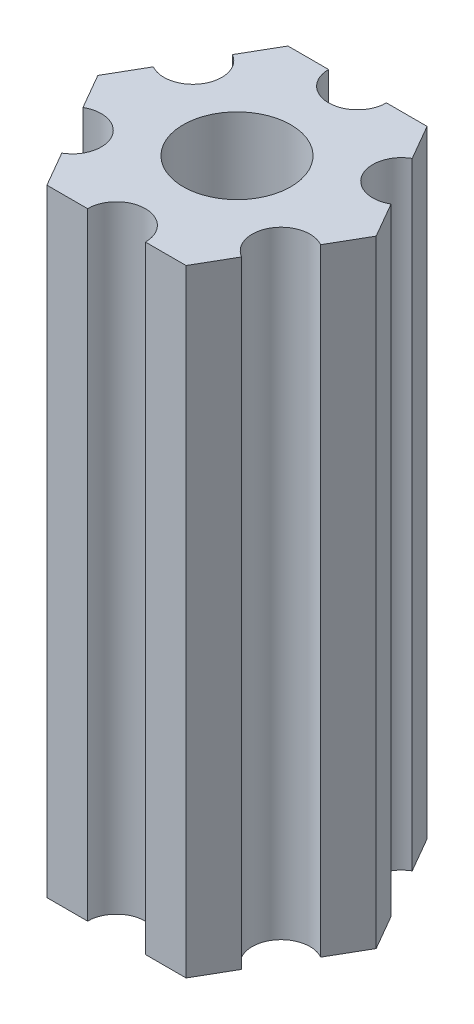
ISO-10303-21;
HEADER;
FILE_DESCRIPTION(('STEP AP214'),'2;1');
FILE_NAME('part.step','',(''),(''),'','','');
FILE_SCHEMA(('AUTOMOTIVE_DESIGN { 1 0 10303 214 1 1 1 1 }'));
ENDSEC;
DATA;
#1=APPLICATION_CONTEXT('core data for automotive mechanical design processes');
#2=APPLICATION_PROTOCOL_DEFINITION('international standard','automotive_design',2000,#1);
#3=PRODUCT_CONTEXT('',#1,'mechanical');
#4=PRODUCT('Part','Part','',(#3));
#5=PRODUCT_RELATED_PRODUCT_CATEGORY('part','',(#4));
#6=PRODUCT_DEFINITION_FORMATION('','',#4);
#7=PRODUCT_DEFINITION_CONTEXT('part definition',#1,'design');
#8=PRODUCT_DEFINITION('design','',#6,#7);
#9=PRODUCT_DEFINITION_SHAPE('','',#8);
#10=(LENGTH_UNIT() NAMED_UNIT(*) SI_UNIT(.MILLI.,.METRE.));
#11=(NAMED_UNIT(*) PLANE_ANGLE_UNIT() SI_UNIT($,.RADIAN.));
#12=(NAMED_UNIT(*) SI_UNIT($,.STERADIAN.) SOLID_ANGLE_UNIT());
#13=UNCERTAINTY_MEASURE_WITH_UNIT(LENGTH_MEASURE(1.E-05),#10,'distance_accuracy_value','');
#14=(GEOMETRIC_REPRESENTATION_CONTEXT(3) GLOBAL_UNCERTAINTY_ASSIGNED_CONTEXT((#13)) GLOBAL_UNIT_ASSIGNED_CONTEXT((#10,
#11,#12)) REPRESENTATION_CONTEXT('',''));
#15=CARTESIAN_POINT('',(0.,0.,0.));
#16=DIRECTION('',(0.,0.,1.));
#17=DIRECTION('',(1.,0.,0.));
#18=AXIS2_PLACEMENT_3D('',#15,#16,#17);
#19=CARTESIAN_POINT('',(5.41265877365274,53.,3.125));
#20=DIRECTION('',(0.,1.,0.));
#21=DIRECTION('',(0.,0.,1.));
#22=AXIS2_PLACEMENT_3D('',#19,#20,#21);
#23=CYLINDRICAL_SURFACE('',#22,1.5);
#24=CARTESIAN_POINT('',(5.41265877365274,85.,3.125));
#25=DIRECTION('',(0.,-1.,0.));
#26=DIRECTION('',(0.,0.,-1.));
#27=AXIS2_PLACEMENT_3D('',#24,#25,#26);
#28=CIRCLE('',#27,1.5);
#29=CARTESIAN_POINT('',(4.66265877365274,85.,4.42403810567666));
#30=VERTEX_POINT('',#29);
#31=CARTESIAN_POINT('',(6.16265877365274,85.,1.82596189432335));
#32=VERTEX_POINT('',#31);
#33=EDGE_CURVE('E196',#30,#32,#28,.T.);
#34=ORIENTED_EDGE('',*,*,#33,.F.);
#35=DIRECTION('',(0.,1.,0.));
#36=VECTOR('',#35,1.);
#37=CARTESIAN_POINT('',(4.66265877365274,53.,4.42403810567666));
#38=LINE('',#37,#36);
#39=CARTESIAN_POINT('',(4.66265877365274,53.,4.42403810567666));
#40=VERTEX_POINT('',#39);
#41=EDGE_CURVE('E11',#40,#30,#38,.T.);
#42=ORIENTED_EDGE('',*,*,#41,.F.);
#43=CARTESIAN_POINT('',(5.41265877365274,53.,3.125));
#44=DIRECTION('',(0.,-1.,0.));
#45=DIRECTION('',(0.,0.,-1.));
#46=AXIS2_PLACEMENT_3D('',#43,#44,#45);
#47=CIRCLE('',#46,1.5);
#48=CARTESIAN_POINT('',(6.16265877365274,53.,1.82596189432335));
#49=VERTEX_POINT('',#48);
#50=EDGE_CURVE('E247',#40,#49,#47,.T.);
#51=ORIENTED_EDGE('',*,*,#50,.T.);
#52=DIRECTION('',(0.,1.,0.));
#53=VECTOR('',#52,1.);
#54=CARTESIAN_POINT('',(6.16265877365274,53.,1.82596189432335));
#55=LINE('',#54,#53);
#56=EDGE_CURVE('E42',#49,#32,#55,.T.);
#57=ORIENTED_EDGE('',*,*,#56,.T.);
#58=EDGE_LOOP('',(#34,#42,#51,#57));
#59=FACE_BOUND('',#58,.T.);
#60=ADVANCED_FACE('F39',(#59),#23,.F.);
#61=CARTESIAN_POINT('',(3.60843918243516,53.,6.25));
#62=DIRECTION('',(0.866025403784439,0.,0.5));
#63=DIRECTION('',(0.5,0.,-0.866025403784439));
#64=AXIS2_PLACEMENT_3D('',#61,#62,#63);
#65=PLANE('',#64);
#66=DIRECTION('',(0.5,0.,-0.866025403784439));
#67=VECTOR('',#66,1.);
#68=CARTESIAN_POINT('',(3.60843918243516,85.,6.25));
#69=LINE('',#68,#67);
#70=CARTESIAN_POINT('',(3.60843918243516,85.,6.25));
#71=VERTEX_POINT('',#70);
#72=EDGE_CURVE('E245',#71,#30,#69,.T.);
#73=ORIENTED_EDGE('',*,*,#72,.F.);
#74=DIRECTION('',(0.,1.,0.));
#75=VECTOR('',#74,1.);
#76=CARTESIAN_POINT('',(3.60843918243516,53.,6.25));
#77=LINE('',#76,#75);
#78=CARTESIAN_POINT('',(3.60843918243516,53.,6.25));
#79=VERTEX_POINT('',#78);
#80=EDGE_CURVE('E48',#79,#71,#77,.T.);
#81=ORIENTED_EDGE('',*,*,#80,.F.);
#82=DIRECTION('',(0.5,0.,-0.866025403784439));
#83=VECTOR('',#82,1.);
#84=CARTESIAN_POINT('',(3.60843918243516,53.,6.25));
#85=LINE('',#84,#83);
#86=EDGE_CURVE('E186',#79,#40,#85,.T.);
#87=ORIENTED_EDGE('',*,*,#86,.T.);
#88=ORIENTED_EDGE('',*,*,#41,.T.);
#89=EDGE_LOOP('',(#73,#81,#87,#88));
#90=FACE_BOUND('',#89,.T.);
#91=ADVANCED_FACE('F279',(#90),#65,.T.);
#92=CARTESIAN_POINT('',(1.5,53.,6.25));
#93=DIRECTION('',(0.,0.,1.));
#94=DIRECTION('',(1.,0.,0.));
#95=AXIS2_PLACEMENT_3D('',#92,#93,#94);
#96=PLANE('',#95);
#97=DIRECTION('',(1.,0.,0.));
#98=VECTOR('',#97,1.);
#99=CARTESIAN_POINT('',(1.5,85.,6.25));
#100=LINE('',#99,#98);
#101=CARTESIAN_POINT('',(1.5,85.,6.25));
#102=VERTEX_POINT('',#101);
#103=EDGE_CURVE('E173',#102,#71,#100,.T.);
#104=ORIENTED_EDGE('',*,*,#103,.F.);
#105=DIRECTION('',(0.,1.,0.));
#106=VECTOR('',#105,1.);
#107=CARTESIAN_POINT('',(1.5,53.,6.25));
#108=LINE('',#107,#106);
#109=CARTESIAN_POINT('',(1.5,53.,6.25));
#110=VERTEX_POINT('',#109);
#111=EDGE_CURVE('E168',#110,#102,#108,.T.);
#112=ORIENTED_EDGE('',*,*,#111,.F.);
#113=DIRECTION('',(1.,0.,0.));
#114=VECTOR('',#113,1.);
#115=CARTESIAN_POINT('',(1.5,53.,6.25));
#116=LINE('',#115,#114);
#117=EDGE_CURVE('E171',#110,#79,#116,.T.);
#118=ORIENTED_EDGE('',*,*,#117,.T.);
#119=ORIENTED_EDGE('',*,*,#80,.T.);
#120=EDGE_LOOP('',(#104,#112,#118,#119));
#121=FACE_BOUND('',#120,.T.);
#122=ADVANCED_FACE('F170',(#121),#96,.T.);
#123=CARTESIAN_POINT('',(0.,53.,6.25));
#124=DIRECTION('',(0.,1.,0.));
#125=DIRECTION('',(0.,0.,1.));
#126=AXIS2_PLACEMENT_3D('',#123,#124,#125);
#127=CYLINDRICAL_SURFACE('',#126,1.5);
#128=CARTESIAN_POINT('',(0.,85.,6.25));
#129=DIRECTION('',(0.,-1.,0.));
#130=DIRECTION('',(0.,0.,-1.));
#131=AXIS2_PLACEMENT_3D('',#128,#129,#130);
#132=CIRCLE('',#131,1.5);
#133=CARTESIAN_POINT('',(-1.5,85.,6.25));
#134=VERTEX_POINT('',#133);
#135=EDGE_CURVE('E242',#134,#102,#132,.T.);
#136=ORIENTED_EDGE('',*,*,#135,.F.);
#137=DIRECTION('',(0.,1.,0.));
#138=VECTOR('',#137,1.);
#139=CARTESIAN_POINT('',(-1.5,53.,6.25));
#140=LINE('',#139,#138);
#141=CARTESIAN_POINT('',(-1.5,53.,6.25));
#142=VERTEX_POINT('',#141);
#143=EDGE_CURVE('E178',#142,#134,#140,.T.);
#144=ORIENTED_EDGE('',*,*,#143,.F.);
#145=CARTESIAN_POINT('',(0.,53.,6.25));
#146=DIRECTION('',(0.,-1.,0.));
#147=DIRECTION('',(0.,0.,-1.));
#148=AXIS2_PLACEMENT_3D('',#145,#146,#147);
#149=CIRCLE('',#148,1.5);
#150=EDGE_CURVE('E184',#142,#110,#149,.T.);
#151=ORIENTED_EDGE('',*,*,#150,.T.);
#152=ORIENTED_EDGE('',*,*,#111,.T.);
#153=EDGE_LOOP('',(#136,#144,#151,#152));
#154=FACE_BOUND('',#153,.T.);
#155=ADVANCED_FACE('F188',(#154),#127,.F.);
#156=CARTESIAN_POINT('',(-3.60843918243516,53.,6.25));
#157=DIRECTION('',(0.,0.,1.));
#158=DIRECTION('',(1.,0.,0.));
#159=AXIS2_PLACEMENT_3D('',#156,#157,#158);
#160=PLANE('',#159);
#161=DIRECTION('',(1.,0.,0.));
#162=VECTOR('',#161,1.);
#163=CARTESIAN_POINT('',(-3.60843918243516,85.,6.25));
#164=LINE('',#163,#162);
#165=CARTESIAN_POINT('',(-3.60843918243516,85.,6.25));
#166=VERTEX_POINT('',#165);
#167=EDGE_CURVE('E239',#166,#134,#164,.T.);
#168=ORIENTED_EDGE('',*,*,#167,.F.);
#169=DIRECTION('',(0.,1.,0.));
#170=VECTOR('',#169,1.);
#171=CARTESIAN_POINT('',(-3.60843918243516,53.,6.25));
#172=LINE('',#171,#170);
#173=CARTESIAN_POINT('',(-3.60843918243516,53.,6.25));
#174=VERTEX_POINT('',#173);
#175=EDGE_CURVE('E251',#174,#166,#172,.T.);
#176=ORIENTED_EDGE('',*,*,#175,.F.);
#177=DIRECTION('',(1.,0.,0.));
#178=VECTOR('',#177,1.);
#179=CARTESIAN_POINT('',(-3.60843918243516,53.,6.25));
#180=LINE('',#179,#178);
#181=EDGE_CURVE('E189',#174,#142,#180,.T.);
#182=ORIENTED_EDGE('',*,*,#181,.T.);
#183=ORIENTED_EDGE('',*,*,#143,.T.);
#184=EDGE_LOOP('',(#168,#176,#182,#183));
#185=FACE_BOUND('',#184,.T.);
#186=ADVANCED_FACE('F292',(#185),#160,.T.);
#187=CARTESIAN_POINT('',(-4.66265877365274,53.,4.42403810567666));
#188=DIRECTION('',(-0.866025403784439,0.,0.5));
#189=DIRECTION('',(0.5,0.,0.866025403784439));
#190=AXIS2_PLACEMENT_3D('',#187,#188,#189);
#191=PLANE('',#190);
#192=DIRECTION('',(0.5,0.,0.866025403784439));
#193=VECTOR('',#192,1.);
#194=CARTESIAN_POINT('',(-4.66265877365274,85.,4.42403810567666));
#195=LINE('',#194,#193);
#196=CARTESIAN_POINT('',(-4.66265877365274,85.,4.42403810567666));
#197=VERTEX_POINT('',#196);
#198=EDGE_CURVE('E236',#197,#166,#195,.T.);
#199=ORIENTED_EDGE('',*,*,#198,.F.);
#200=DIRECTION('',(0.,1.,0.));
#201=VECTOR('',#200,1.);
#202=CARTESIAN_POINT('',(-4.66265877365274,53.,4.42403810567666));
#203=LINE('',#202,#201);
#204=CARTESIAN_POINT('',(-4.66265877365274,53.,4.42403810567666));
#205=VERTEX_POINT('',#204);
#206=EDGE_CURVE('E253',#205,#197,#203,.T.);
#207=ORIENTED_EDGE('',*,*,#206,.F.);
#208=DIRECTION('',(0.5,0.,0.866025403784439));
#209=VECTOR('',#208,1.);
#210=CARTESIAN_POINT('',(-4.66265877365274,53.,4.42403810567666));
#211=LINE('',#210,#209);
#212=EDGE_CURVE('E191',#205,#174,#211,.T.);
#213=ORIENTED_EDGE('',*,*,#212,.T.);
#214=ORIENTED_EDGE('',*,*,#175,.T.);
#215=EDGE_LOOP('',(#199,#207,#213,#214));
#216=FACE_BOUND('',#215,.T.);
#217=ADVANCED_FACE('F295',(#216),#191,.T.);
#218=CARTESIAN_POINT('',(-5.41265877365274,53.,3.125));
#219=DIRECTION('',(0.,1.,0.));
#220=DIRECTION('',(0.,0.,1.));
#221=AXIS2_PLACEMENT_3D('',#218,#219,#220);
#222=CYLINDRICAL_SURFACE('',#221,1.5);
#223=CARTESIAN_POINT('',(-5.41265877365274,85.,3.125));
#224=DIRECTION('',(0.,-1.,0.));
#225=DIRECTION('',(0.,0.,-1.));
#226=AXIS2_PLACEMENT_3D('',#223,#224,#225);
#227=CIRCLE('',#226,1.5);
#228=CARTESIAN_POINT('',(-6.16265877365274,85.,1.82596189432335));
#229=VERTEX_POINT('',#228);
#230=EDGE_CURVE('E233',#229,#197,#227,.T.);
#231=ORIENTED_EDGE('',*,*,#230,.F.);
#232=DIRECTION('',(0.,1.,0.));
#233=VECTOR('',#232,1.);
#234=CARTESIAN_POINT('',(-6.16265877365274,53.,1.82596189432335));
#235=LINE('',#234,#233);
#236=CARTESIAN_POINT('',(-6.16265877365274,53.,1.82596189432335));
#237=VERTEX_POINT('',#236);
#238=EDGE_CURVE('E255',#237,#229,#235,.T.);
#239=ORIENTED_EDGE('',*,*,#238,.F.);
#240=CARTESIAN_POINT('',(-5.41265877365274,53.,3.125));
#241=DIRECTION('',(0.,-1.,0.));
#242=DIRECTION('',(0.,0.,-1.));
#243=AXIS2_PLACEMENT_3D('',#240,#241,#242);
#244=CIRCLE('',#243,1.5);
#245=EDGE_CURVE('E400',#237,#205,#244,.T.);
#246=ORIENTED_EDGE('',*,*,#245,.T.);
#247=ORIENTED_EDGE('',*,*,#206,.T.);
#248=EDGE_LOOP('',(#231,#239,#246,#247));
#249=FACE_BOUND('',#248,.T.);
#250=ADVANCED_FACE('F299',(#249),#222,.F.);
#251=CARTESIAN_POINT('',(-7.21687836487032,53.,0.));
#252=DIRECTION('',(-0.86602540378444,0.,0.499999999999998));
#253=DIRECTION('',(0.499999999999998,0.,0.86602540378444));
#254=AXIS2_PLACEMENT_3D('',#251,#252,#253);
#255=PLANE('',#254);
#256=DIRECTION('',(0.499999999999998,0.,0.86602540378444));
#257=VECTOR('',#256,1.);
#258=CARTESIAN_POINT('',(-7.21687836487032,85.,0.));
#259=LINE('',#258,#257);
#260=CARTESIAN_POINT('',(-7.21687836487032,85.,0.));
#261=VERTEX_POINT('',#260);
#262=EDGE_CURVE('E230',#261,#229,#259,.T.);
#263=ORIENTED_EDGE('',*,*,#262,.F.);
#264=DIRECTION('',(0.,1.,0.));
#265=VECTOR('',#264,1.);
#266=CARTESIAN_POINT('',(-7.21687836487032,53.,0.));
#267=LINE('',#266,#265);
#268=CARTESIAN_POINT('',(-7.21687836487032,53.,0.));
#269=VERTEX_POINT('',#268);
#270=EDGE_CURVE('E257',#269,#261,#267,.T.);
#271=ORIENTED_EDGE('',*,*,#270,.F.);
#272=DIRECTION('',(0.499999999999998,0.,0.86602540378444));
#273=VECTOR('',#272,1.);
#274=CARTESIAN_POINT('',(-7.21687836487032,53.,0.));
#275=LINE('',#274,#273);
#276=EDGE_CURVE('E397',#269,#237,#275,.T.);
#277=ORIENTED_EDGE('',*,*,#276,.T.);
#278=ORIENTED_EDGE('',*,*,#238,.T.);
#279=EDGE_LOOP('',(#263,#271,#277,#278));
#280=FACE_BOUND('',#279,.T.);
#281=ADVANCED_FACE('F303',(#280),#255,.T.);
#282=CARTESIAN_POINT('',(-6.16265877365274,53.,-1.82596189432334));
#283=DIRECTION('',(-0.866025403784438,0.,-0.5));
#284=DIRECTION('',(-0.5,0.,0.866025403784438));
#285=AXIS2_PLACEMENT_3D('',#282,#283,#284);
#286=PLANE('',#285);
#287=DIRECTION('',(-0.5,0.,0.866025403784438));
#288=VECTOR('',#287,1.);
#289=CARTESIAN_POINT('',(-6.16265877365274,85.,-1.82596189432334));
#290=LINE('',#289,#288);
#291=CARTESIAN_POINT('',(-6.16265877365274,85.,-1.82596189432334));
#292=VERTEX_POINT('',#291);
#293=EDGE_CURVE('E227',#292,#261,#290,.T.);
#294=ORIENTED_EDGE('',*,*,#293,.F.);
#295=DIRECTION('',(0.,1.,0.));
#296=VECTOR('',#295,1.);
#297=CARTESIAN_POINT('',(-6.16265877365274,53.,-1.82596189432334));
#298=LINE('',#297,#296);
#299=CARTESIAN_POINT('',(-6.16265877365274,53.,-1.82596189432334));
#300=VERTEX_POINT('',#299);
#301=EDGE_CURVE('E259',#300,#292,#298,.T.);
#302=ORIENTED_EDGE('',*,*,#301,.F.);
#303=DIRECTION('',(-0.5,0.,0.866025403784438));
#304=VECTOR('',#303,1.);
#305=CARTESIAN_POINT('',(-6.16265877365274,53.,-1.82596189432334));
#306=LINE('',#305,#304);
#307=EDGE_CURVE('E394',#300,#269,#306,.T.);
#308=ORIENTED_EDGE('',*,*,#307,.T.);
#309=ORIENTED_EDGE('',*,*,#270,.T.);
#310=EDGE_LOOP('',(#294,#302,#308,#309));
#311=FACE_BOUND('',#310,.T.);
#312=ADVANCED_FACE('F307',(#311),#286,.T.);
#313=CARTESIAN_POINT('',(-5.41265877365274,53.,-3.125));
#314=DIRECTION('',(0.,1.,0.));
#315=DIRECTION('',(0.,0.,1.));
#316=AXIS2_PLACEMENT_3D('',#313,#314,#315);
#317=CYLINDRICAL_SURFACE('',#316,1.5);
#318=CARTESIAN_POINT('',(-5.41265877365274,85.,-3.125));
#319=DIRECTION('',(0.,-1.,0.));
#320=DIRECTION('',(0.,0.,-1.));
#321=AXIS2_PLACEMENT_3D('',#318,#319,#320);
#322=CIRCLE('',#321,1.5);
#323=CARTESIAN_POINT('',(-4.66265877365274,85.,-4.42403810567666));
#324=VERTEX_POINT('',#323);
#325=EDGE_CURVE('E224',#324,#292,#322,.T.);
#326=ORIENTED_EDGE('',*,*,#325,.F.);
#327=DIRECTION('',(0.,1.,0.));
#328=VECTOR('',#327,1.);
#329=CARTESIAN_POINT('',(-4.66265877365274,53.,-4.42403810567666));
#330=LINE('',#329,#328);
#331=CARTESIAN_POINT('',(-4.66265877365274,53.,-4.42403810567666));
#332=VERTEX_POINT('',#331);
#333=EDGE_CURVE('E261',#332,#324,#330,.T.);
#334=ORIENTED_EDGE('',*,*,#333,.F.);
#335=CARTESIAN_POINT('',(-5.41265877365274,53.,-3.125));
#336=DIRECTION('',(0.,-1.,0.));
#337=DIRECTION('',(0.,0.,-1.));
#338=AXIS2_PLACEMENT_3D('',#335,#336,#337);
#339=CIRCLE('',#338,1.5);
#340=EDGE_CURVE('E391',#332,#300,#339,.T.);
#341=ORIENTED_EDGE('',*,*,#340,.T.);
#342=ORIENTED_EDGE('',*,*,#301,.T.);
#343=EDGE_LOOP('',(#326,#334,#341,#342));
#344=FACE_BOUND('',#343,.T.);
#345=ADVANCED_FACE('F311',(#344),#317,.F.);
#346=CARTESIAN_POINT('',(-3.60843918243516,53.,-6.25));
#347=DIRECTION('',(-0.866025403784439,0.,-0.5));
#348=DIRECTION('',(-0.5,0.,0.866025403784439));
#349=AXIS2_PLACEMENT_3D('',#346,#347,#348);
#350=PLANE('',#349);
#351=DIRECTION('',(-0.5,0.,0.866025403784439));
#352=VECTOR('',#351,1.);
#353=CARTESIAN_POINT('',(-3.60843918243516,85.,-6.25));
#354=LINE('',#353,#352);
#355=CARTESIAN_POINT('',(-3.60843918243516,85.,-6.25));
#356=VERTEX_POINT('',#355);
#357=EDGE_CURVE('E221',#356,#324,#354,.T.);
#358=ORIENTED_EDGE('',*,*,#357,.F.);
#359=DIRECTION('',(0.,1.,0.));
#360=VECTOR('',#359,1.);
#361=CARTESIAN_POINT('',(-3.60843918243516,53.,-6.25));
#362=LINE('',#361,#360);
#363=CARTESIAN_POINT('',(-3.60843918243516,53.,-6.25));
#364=VERTEX_POINT('',#363);
#365=EDGE_CURVE('E263',#364,#356,#362,.T.);
#366=ORIENTED_EDGE('',*,*,#365,.F.);
#367=DIRECTION('',(-0.5,0.,0.866025403784439));
#368=VECTOR('',#367,1.);
#369=CARTESIAN_POINT('',(-3.60843918243516,53.,-6.25));
#370=LINE('',#369,#368);
#371=EDGE_CURVE('E388',#364,#332,#370,.T.);
#372=ORIENTED_EDGE('',*,*,#371,.T.);
#373=ORIENTED_EDGE('',*,*,#333,.T.);
#374=EDGE_LOOP('',(#358,#366,#372,#373));
#375=FACE_BOUND('',#374,.T.);
#376=ADVANCED_FACE('F315',(#375),#350,.T.);
#377=CARTESIAN_POINT('',(-1.5,53.,-6.25));
#378=DIRECTION('',(0.,0.,-1.));
#379=DIRECTION('',(-1.,0.,0.));
#380=AXIS2_PLACEMENT_3D('',#377,#378,#379);
#381=PLANE('',#380);
#382=DIRECTION('',(-1.,0.,0.));
#383=VECTOR('',#382,1.);
#384=CARTESIAN_POINT('',(-1.5,85.,-6.25));
#385=LINE('',#384,#383);
#386=CARTESIAN_POINT('',(-1.5,85.,-6.25));
#387=VERTEX_POINT('',#386);
#388=EDGE_CURVE('E218',#387,#356,#385,.T.);
#389=ORIENTED_EDGE('',*,*,#388,.F.);
#390=DIRECTION('',(0.,1.,0.));
#391=VECTOR('',#390,1.);
#392=CARTESIAN_POINT('',(-1.5,53.,-6.25));
#393=LINE('',#392,#391);
#394=CARTESIAN_POINT('',(-1.5,53.,-6.25));
#395=VERTEX_POINT('',#394);
#396=EDGE_CURVE('E265',#395,#387,#393,.T.);
#397=ORIENTED_EDGE('',*,*,#396,.F.);
#398=DIRECTION('',(-1.,0.,0.));
#399=VECTOR('',#398,1.);
#400=CARTESIAN_POINT('',(-1.5,53.,-6.25));
#401=LINE('',#400,#399);
#402=EDGE_CURVE('E385',#395,#364,#401,.T.);
#403=ORIENTED_EDGE('',*,*,#402,.T.);
#404=ORIENTED_EDGE('',*,*,#365,.T.);
#405=EDGE_LOOP('',(#389,#397,#403,#404));
#406=FACE_BOUND('',#405,.T.);
#407=ADVANCED_FACE('F319',(#406),#381,.T.);
#408=CARTESIAN_POINT('',(0.,53.,-6.25));
#409=DIRECTION('',(0.,1.,0.));
#410=DIRECTION('',(0.,0.,1.));
#411=AXIS2_PLACEMENT_3D('',#408,#409,#410);
#412=CYLINDRICAL_SURFACE('',#411,1.5);
#413=CARTESIAN_POINT('',(0.,85.,-6.25));
#414=DIRECTION('',(0.,-1.,0.));
#415=DIRECTION('',(0.,0.,-1.));
#416=AXIS2_PLACEMENT_3D('',#413,#414,#415);
#417=CIRCLE('',#416,1.5);
#418=CARTESIAN_POINT('',(1.5,85.,-6.25));
#419=VERTEX_POINT('',#418);
#420=EDGE_CURVE('E215',#419,#387,#417,.T.);
#421=ORIENTED_EDGE('',*,*,#420,.F.);
#422=DIRECTION('',(0.,1.,0.));
#423=VECTOR('',#422,1.);
#424=CARTESIAN_POINT('',(1.5,53.,-6.25));
#425=LINE('',#424,#423);
#426=CARTESIAN_POINT('',(1.5,53.,-6.25));
#427=VERTEX_POINT('',#426);
#428=EDGE_CURVE('E267',#427,#419,#425,.T.);
#429=ORIENTED_EDGE('',*,*,#428,.F.);
#430=CARTESIAN_POINT('',(0.,53.,-6.25));
#431=DIRECTION('',(0.,-1.,0.));
#432=DIRECTION('',(0.,0.,-1.));
#433=AXIS2_PLACEMENT_3D('',#430,#431,#432);
#434=CIRCLE('',#433,1.5);
#435=EDGE_CURVE('E382',#427,#395,#434,.T.);
#436=ORIENTED_EDGE('',*,*,#435,.T.);
#437=ORIENTED_EDGE('',*,*,#396,.T.);
#438=EDGE_LOOP('',(#421,#429,#436,#437));
#439=FACE_BOUND('',#438,.T.);
#440=ADVANCED_FACE('F323',(#439),#412,.F.);
#441=CARTESIAN_POINT('',(3.60843918243516,53.,-6.25));
#442=DIRECTION('',(0.,0.,-1.));
#443=DIRECTION('',(-1.,0.,0.));
#444=AXIS2_PLACEMENT_3D('',#441,#442,#443);
#445=PLANE('',#444);
#446=DIRECTION('',(-1.,0.,0.));
#447=VECTOR('',#446,1.);
#448=CARTESIAN_POINT('',(3.60843918243516,85.,-6.25));
#449=LINE('',#448,#447);
#450=CARTESIAN_POINT('',(3.60843918243516,85.,-6.25));
#451=VERTEX_POINT('',#450);
#452=EDGE_CURVE('E212',#451,#419,#449,.T.);
#453=ORIENTED_EDGE('',*,*,#452,.F.);
#454=DIRECTION('',(0.,1.,0.));
#455=VECTOR('',#454,1.);
#456=CARTESIAN_POINT('',(3.60843918243516,53.,-6.25));
#457=LINE('',#456,#455);
#458=CARTESIAN_POINT('',(3.60843918243516,53.,-6.25));
#459=VERTEX_POINT('',#458);
#460=EDGE_CURVE('E269',#459,#451,#457,.T.);
#461=ORIENTED_EDGE('',*,*,#460,.F.);
#462=DIRECTION('',(-1.,0.,0.));
#463=VECTOR('',#462,1.);
#464=CARTESIAN_POINT('',(3.60843918243516,53.,-6.25));
#465=LINE('',#464,#463);
#466=EDGE_CURVE('E379',#459,#427,#465,.T.);
#467=ORIENTED_EDGE('',*,*,#466,.T.);
#468=ORIENTED_EDGE('',*,*,#428,.T.);
#469=EDGE_LOOP('',(#453,#461,#467,#468));
#470=FACE_BOUND('',#469,.T.);
#471=ADVANCED_FACE('F327',(#470),#445,.T.);
#472=CARTESIAN_POINT('',(4.66265877365274,53.,-4.42403810567666));
#473=DIRECTION('',(0.866025403784439,0.,-0.5));
#474=DIRECTION('',(-0.5,0.,-0.866025403784439));
#475=AXIS2_PLACEMENT_3D('',#472,#473,#474);
#476=PLANE('',#475);
#477=DIRECTION('',(-0.5,0.,-0.866025403784439));
#478=VECTOR('',#477,1.);
#479=CARTESIAN_POINT('',(4.66265877365274,85.,-4.42403810567666));
#480=LINE('',#479,#478);
#481=CARTESIAN_POINT('',(4.66265877365274,85.,-4.42403810567666));
#482=VERTEX_POINT('',#481);
#483=EDGE_CURVE('E209',#482,#451,#480,.T.);
#484=ORIENTED_EDGE('',*,*,#483,.F.);
#485=DIRECTION('',(0.,1.,0.));
#486=VECTOR('',#485,1.);
#487=CARTESIAN_POINT('',(4.66265877365274,53.,-4.42403810567666));
#488=LINE('',#487,#486);
#489=CARTESIAN_POINT('',(4.66265877365274,53.,-4.42403810567666));
#490=VERTEX_POINT('',#489);
#491=EDGE_CURVE('E271',#490,#482,#488,.T.);
#492=ORIENTED_EDGE('',*,*,#491,.F.);
#493=DIRECTION('',(-0.5,0.,-0.866025403784439));
#494=VECTOR('',#493,1.);
#495=CARTESIAN_POINT('',(4.66265877365274,53.,-4.42403810567666));
#496=LINE('',#495,#494);
#497=EDGE_CURVE('E376',#490,#459,#496,.T.);
#498=ORIENTED_EDGE('',*,*,#497,.T.);
#499=ORIENTED_EDGE('',*,*,#460,.T.);
#500=EDGE_LOOP('',(#484,#492,#498,#499));
#501=FACE_BOUND('',#500,.T.);
#502=ADVANCED_FACE('F331',(#501),#476,.T.);
#503=CARTESIAN_POINT('',(5.41265877365274,53.,-3.125));
#504=DIRECTION('',(0.,1.,0.));
#505=DIRECTION('',(0.,0.,1.));
#506=AXIS2_PLACEMENT_3D('',#503,#504,#505);
#507=CYLINDRICAL_SURFACE('',#506,1.5);
#508=CARTESIAN_POINT('',(5.41265877365274,85.,-3.125));
#509=DIRECTION('',(0.,-1.,0.));
#510=DIRECTION('',(0.,0.,-1.));
#511=AXIS2_PLACEMENT_3D('',#508,#509,#510);
#512=CIRCLE('',#511,1.5);
#513=CARTESIAN_POINT('',(6.16265877365274,85.,-1.82596189432334));
#514=VERTEX_POINT('',#513);
#515=EDGE_CURVE('E206',#514,#482,#512,.T.);
#516=ORIENTED_EDGE('',*,*,#515,.F.);
#517=DIRECTION('',(0.,1.,0.));
#518=VECTOR('',#517,1.);
#519=CARTESIAN_POINT('',(6.16265877365274,53.,-1.82596189432334));
#520=LINE('',#519,#518);
#521=CARTESIAN_POINT('',(6.16265877365274,53.,-1.82596189432334));
#522=VERTEX_POINT('',#521);
#523=EDGE_CURVE('E273',#522,#514,#520,.T.);
#524=ORIENTED_EDGE('',*,*,#523,.F.);
#525=CARTESIAN_POINT('',(5.41265877365274,53.,-3.125));
#526=DIRECTION('',(0.,-1.,0.));
#527=DIRECTION('',(0.,0.,-1.));
#528=AXIS2_PLACEMENT_3D('',#525,#526,#527);
#529=CIRCLE('',#528,1.5);
#530=EDGE_CURVE('E373',#522,#490,#529,.T.);
#531=ORIENTED_EDGE('',*,*,#530,.T.);
#532=ORIENTED_EDGE('',*,*,#491,.T.);
#533=EDGE_LOOP('',(#516,#524,#531,#532));
#534=FACE_BOUND('',#533,.T.);
#535=ADVANCED_FACE('F335',(#534),#507,.F.);
#536=CARTESIAN_POINT('',(7.21687836487032,53.,0.));
#537=DIRECTION('',(0.866025403784439,0.,-0.5));
#538=DIRECTION('',(-0.5,0.,-0.866025403784439));
#539=AXIS2_PLACEMENT_3D('',#536,#537,#538);
#540=PLANE('',#539);
#541=DIRECTION('',(-0.5,0.,-0.866025403784439));
#542=VECTOR('',#541,1.);
#543=CARTESIAN_POINT('',(7.21687836487032,85.,0.));
#544=LINE('',#543,#542);
#545=CARTESIAN_POINT('',(7.21687836487032,85.,0.));
#546=VERTEX_POINT('',#545);
#547=EDGE_CURVE('E203',#546,#514,#544,.T.);
#548=ORIENTED_EDGE('',*,*,#547,.F.);
#549=DIRECTION('',(0.,1.,0.));
#550=VECTOR('',#549,1.);
#551=CARTESIAN_POINT('',(7.21687836487032,53.,0.));
#552=LINE('',#551,#550);
#553=CARTESIAN_POINT('',(7.21687836487032,53.,0.));
#554=VERTEX_POINT('',#553);
#555=EDGE_CURVE('E274',#554,#546,#552,.T.);
#556=ORIENTED_EDGE('',*,*,#555,.F.);
#557=DIRECTION('',(-0.5,0.,-0.866025403784439));
#558=VECTOR('',#557,1.);
#559=CARTESIAN_POINT('',(7.21687836487032,53.,0.));
#560=LINE('',#559,#558);
#561=EDGE_CURVE('E370',#554,#522,#560,.T.);
#562=ORIENTED_EDGE('',*,*,#561,.T.);
#563=ORIENTED_EDGE('',*,*,#523,.T.);
#564=EDGE_LOOP('',(#548,#556,#562,#563));
#565=FACE_BOUND('',#564,.T.);
#566=ADVANCED_FACE('F339',(#565),#540,.T.);
#567=CARTESIAN_POINT('',(6.16265877365274,53.,1.82596189432335));
#568=DIRECTION('',(0.86602540378444,0.,0.499999999999999));
#569=DIRECTION('',(0.499999999999999,0.,-0.86602540378444));
#570=AXIS2_PLACEMENT_3D('',#567,#568,#569);
#571=PLANE('',#570);
#572=DIRECTION('',(0.499999999999999,0.,-0.86602540378444));
#573=VECTOR('',#572,1.);
#574=CARTESIAN_POINT('',(6.16265877365274,85.,1.82596189432335));
#575=LINE('',#574,#573);
#576=EDGE_CURVE('E199',#32,#546,#575,.T.);
#577=ORIENTED_EDGE('',*,*,#576,.F.);
#578=ORIENTED_EDGE('',*,*,#56,.F.);
#579=DIRECTION('',(0.499999999999999,0.,-0.86602540378444));
#580=VECTOR('',#579,1.);
#581=CARTESIAN_POINT('',(6.16265877365274,53.,1.82596189432335));
#582=LINE('',#581,#580);
#583=EDGE_CURVE('E368',#49,#554,#582,.T.);
#584=ORIENTED_EDGE('',*,*,#583,.T.);
#585=ORIENTED_EDGE('',*,*,#555,.T.);
#586=EDGE_LOOP('',(#577,#578,#584,#585));
#587=FACE_BOUND('',#586,.T.);
#588=ADVANCED_FACE('F276',(#587),#571,.T.);
#589=CARTESIAN_POINT('',(5.41265877365274,53.,3.125));
#590=DIRECTION('',(0.,-1.,0.));
#591=DIRECTION('',(0.,0.,-1.));
#592=AXIS2_PLACEMENT_3D('',#589,#590,#591);
#593=PLANE('',#592);
#594=CARTESIAN_POINT('',(0.,53.,0.));
#595=DIRECTION('',(0.,1.,0.));
#596=DIRECTION('',(0.,0.,-1.));
#597=AXIS2_PLACEMENT_3D('',#594,#595,#596);
#598=CIRCLE('',#597,2.79);
#599=CARTESIAN_POINT('',(0.,53.,-2.79));
#600=VERTEX_POINT('',#599);
#601=EDGE_CURVE('E200',#600,#600,#598,.T.);
#602=ORIENTED_EDGE('',*,*,#601,.T.);
#603=EDGE_LOOP('',(#602));
#604=FACE_BOUND('',#603,.T.);
#605=ORIENTED_EDGE('',*,*,#50,.F.);
#606=ORIENTED_EDGE('',*,*,#86,.F.);
#607=ORIENTED_EDGE('',*,*,#117,.F.);
#608=ORIENTED_EDGE('',*,*,#150,.F.);
#609=ORIENTED_EDGE('',*,*,#181,.F.);
#610=ORIENTED_EDGE('',*,*,#212,.F.);
#611=ORIENTED_EDGE('',*,*,#245,.F.);
#612=ORIENTED_EDGE('',*,*,#276,.F.);
#613=ORIENTED_EDGE('',*,*,#307,.F.);
#614=ORIENTED_EDGE('',*,*,#340,.F.);
#615=ORIENTED_EDGE('',*,*,#371,.F.);
#616=ORIENTED_EDGE('',*,*,#402,.F.);
#617=ORIENTED_EDGE('',*,*,#435,.F.);
#618=ORIENTED_EDGE('',*,*,#466,.F.);
#619=ORIENTED_EDGE('',*,*,#497,.F.);
#620=ORIENTED_EDGE('',*,*,#530,.F.);
#621=ORIENTED_EDGE('',*,*,#561,.F.);
#622=ORIENTED_EDGE('',*,*,#583,.F.);
#623=EDGE_LOOP('',(#605,#606,#607,#608,#609,#610,#611,#612,#613,#614,#615,#616,#617,#618,#619,
#620,#621,#622));
#624=FACE_BOUND('',#623,.T.);
#625=ADVANCED_FACE('F182',(#604,#624),#593,.T.);
#626=CARTESIAN_POINT('',(5.41265877365274,85.,3.125));
#627=DIRECTION('',(0.,-1.,0.));
#628=DIRECTION('',(0.,0.,-1.));
#629=AXIS2_PLACEMENT_3D('',#626,#627,#628);
#630=PLANE('',#629);
#631=CARTESIAN_POINT('',(0.,85.,0.));
#632=DIRECTION('',(0.,1.,0.));
#633=DIRECTION('',(0.,0.,-1.));
#634=AXIS2_PLACEMENT_3D('',#631,#632,#633);
#635=CIRCLE('',#634,2.79);
#636=CARTESIAN_POINT('',(0.,85.,-2.79));
#637=VERTEX_POINT('',#636);
#638=EDGE_CURVE('E363',#637,#637,#635,.T.);
#639=ORIENTED_EDGE('',*,*,#638,.F.);
#640=EDGE_LOOP('',(#639));
#641=FACE_BOUND('',#640,.T.);
#642=ORIENTED_EDGE('',*,*,#33,.T.);
#643=ORIENTED_EDGE('',*,*,#576,.T.);
#644=ORIENTED_EDGE('',*,*,#547,.T.);
#645=ORIENTED_EDGE('',*,*,#515,.T.);
#646=ORIENTED_EDGE('',*,*,#483,.T.);
#647=ORIENTED_EDGE('',*,*,#452,.T.);
#648=ORIENTED_EDGE('',*,*,#420,.T.);
#649=ORIENTED_EDGE('',*,*,#388,.T.);
#650=ORIENTED_EDGE('',*,*,#357,.T.);
#651=ORIENTED_EDGE('',*,*,#325,.T.);
#652=ORIENTED_EDGE('',*,*,#293,.T.);
#653=ORIENTED_EDGE('',*,*,#262,.T.);
#654=ORIENTED_EDGE('',*,*,#230,.T.);
#655=ORIENTED_EDGE('',*,*,#198,.T.);
#656=ORIENTED_EDGE('',*,*,#167,.T.);
#657=ORIENTED_EDGE('',*,*,#135,.T.);
#658=ORIENTED_EDGE('',*,*,#103,.T.);
#659=ORIENTED_EDGE('',*,*,#72,.T.);
#660=EDGE_LOOP('',(#642,#643,#644,#645,#646,#647,#648,#649,#650,#651,#652,#653,#654,#655,#656,
#657,#658,#659));
#661=FACE_BOUND('',#660,.T.);
#662=ADVANCED_FACE('F278',(#641,#661),#630,.F.);
#663=CARTESIAN_POINT('',(0.,53.,0.));
#664=DIRECTION('',(0.,1.,0.));
#665=DIRECTION('',(0.,0.,1.));
#666=AXIS2_PLACEMENT_3D('',#663,#664,#665);
#667=CYLINDRICAL_SURFACE('',#666,2.79);
#668=ORIENTED_EDGE('',*,*,#601,.F.);
#669=EDGE_LOOP('',(#668));
#670=FACE_BOUND('',#669,.T.);
#671=ORIENTED_EDGE('',*,*,#638,.T.);
#672=EDGE_LOOP('',(#671));
#673=FACE_BOUND('',#672,.T.);
#674=ADVANCED_FACE('F351',(#670,#673),#667,.F.);
#675=CLOSED_SHELL('',(#60,#91,#122,#155,#186,#217,#250,#281,#312,#345,#376,#407,#440,#471,#502,
#535,#566,#588,#625,#662,#674));
#676=MANIFOLD_SOLID_BREP('B2',#675);
#677=ADVANCED_BREP_SHAPE_REPRESENTATION('',(#18,#676),#14);
#678=SHAPE_DEFINITION_REPRESENTATION(#9,#677);
ENDSEC;
END-ISO-10303-21;
